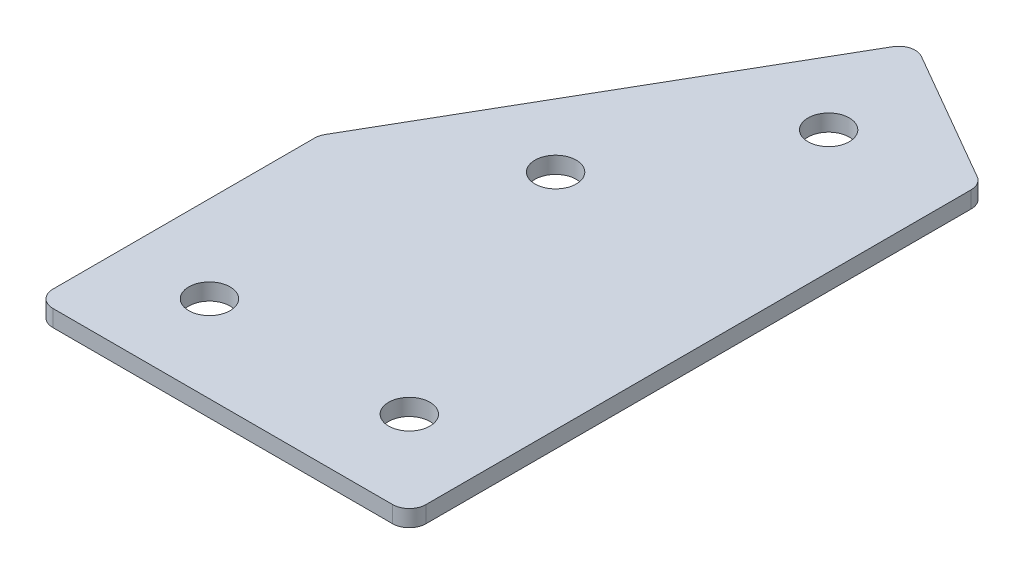
ISO-10303-21;
HEADER;
FILE_DESCRIPTION(('STEP AP214'),'2;1');
FILE_NAME('part.step','',(''),(''),'','','');
FILE_SCHEMA(('AUTOMOTIVE_DESIGN { 1 0 10303 214 1 1 1 1 }'));
ENDSEC;
DATA;
#1=APPLICATION_CONTEXT('core data for automotive mechanical design processes');
#2=APPLICATION_PROTOCOL_DEFINITION('international standard','automotive_design',2000,#1);
#3=PRODUCT_CONTEXT('',#1,'mechanical');
#4=PRODUCT('Part','Part','',(#3));
#5=PRODUCT_RELATED_PRODUCT_CATEGORY('part','',(#4));
#6=PRODUCT_DEFINITION_FORMATION('','',#4);
#7=PRODUCT_DEFINITION_CONTEXT('part definition',#1,'design');
#8=PRODUCT_DEFINITION('design','',#6,#7);
#9=PRODUCT_DEFINITION_SHAPE('','',#8);
#10=(LENGTH_UNIT() NAMED_UNIT(*) SI_UNIT(.MILLI.,.METRE.));
#11=(NAMED_UNIT(*) PLANE_ANGLE_UNIT() SI_UNIT($,.RADIAN.));
#12=(NAMED_UNIT(*) SI_UNIT($,.STERADIAN.) SOLID_ANGLE_UNIT());
#13=UNCERTAINTY_MEASURE_WITH_UNIT(LENGTH_MEASURE(1.E-05),#10,'distance_accuracy_value','');
#14=(GEOMETRIC_REPRESENTATION_CONTEXT(3) GLOBAL_UNCERTAINTY_ASSIGNED_CONTEXT((#13)) GLOBAL_UNIT_ASSIGNED_CONTEXT((#10,
#11,#12)) REPRESENTATION_CONTEXT('',''));
#15=CARTESIAN_POINT('',(0.,0.,0.));
#16=DIRECTION('',(0.,0.,1.));
#17=DIRECTION('',(1.,0.,0.));
#18=AXIS2_PLACEMENT_3D('',#15,#16,#17);
#19=CARTESIAN_POINT('',(0.,0.,0.));
#20=DIRECTION('',(0.,1.,0.));
#21=DIRECTION('',(0.,0.,1.));
#22=AXIS2_PLACEMENT_3D('',#19,#20,#21);
#23=PLANE('',#22);
#24=CARTESIAN_POINT('',(45.0000000000028,0.,0.));
#25=DIRECTION('',(0.,1.,0.));
#26=DIRECTION('',(0.,0.,1.));
#27=AXIS2_PLACEMENT_3D('',#24,#25,#26);
#28=CIRCLE('',#27,3.09999999999999);
#29=CARTESIAN_POINT('',(45.0000000000028,0.,3.09999999999999));
#30=VERTEX_POINT('',#29);
#31=EDGE_CURVE('E201',#30,#30,#28,.T.);
#32=ORIENTED_EDGE('',*,*,#31,.T.);
#33=EDGE_LOOP('',(#32));
#34=FACE_BOUND('',#33,.T.);
#35=CARTESIAN_POINT('',(39.509618943236,0.,-68.4326673973654));
#36=DIRECTION('',(0.,1.,0.));
#37=DIRECTION('',(0.,0.,1.));
#38=AXIS2_PLACEMENT_3D('',#35,#36,#37);
#39=CIRCLE('',#38,3.09999999999999);
#40=CARTESIAN_POINT('',(39.509618943236,0.,-65.3326673973654));
#41=VERTEX_POINT('',#40);
#42=EDGE_CURVE('E195',#41,#41,#39,.T.);
#43=ORIENTED_EDGE('',*,*,#42,.T.);
#44=EDGE_LOOP('',(#43));
#45=FACE_BOUND('',#44,.T.);
#46=CARTESIAN_POINT('',(24.509618943236,0.,-42.4519052838322));
#47=DIRECTION('',(0.,1.,0.));
#48=DIRECTION('',(0.,0.,1.));
#49=AXIS2_PLACEMENT_3D('',#46,#47,#48);
#50=CIRCLE('',#49,3.1);
#51=CARTESIAN_POINT('',(24.509618943236,0.,-39.3519052838323));
#52=VERTEX_POINT('',#51);
#53=EDGE_CURVE('E189',#52,#52,#50,.T.);
#54=ORIENTED_EDGE('',*,*,#53,.T.);
#55=EDGE_LOOP('',(#54));
#56=FACE_BOUND('',#55,.T.);
#57=CARTESIAN_POINT('',(15.0000000000028,0.,0.));
#58=DIRECTION('',(0.,1.,0.));
#59=DIRECTION('',(0.,0.,1.));
#60=AXIS2_PLACEMENT_3D('',#57,#58,#59);
#61=CIRCLE('',#60,3.1);
#62=CARTESIAN_POINT('',(15.0000000000028,0.,3.10000000000002));
#63=VERTEX_POINT('',#62);
#64=EDGE_CURVE('E115',#63,#63,#61,.T.);
#65=ORIENTED_EDGE('',*,*,#64,.T.);
#66=EDGE_LOOP('',(#65));
#67=FACE_BOUND('',#66,.T.);
#68=DIRECTION('',(0.,0.,1.));
#69=VECTOR('',#68,1.);
#70=CARTESIAN_POINT('',(2.00000000000279,0.,-29.4641016151382));
#71=LINE('',#70,#69);
#72=CARTESIAN_POINT('',(2.00000000000279,0.,-28.7942286340604));
#73=VERTEX_POINT('',#72);
#74=CARTESIAN_POINT('',(2.00000000000282,0.,10.5000000000001));
#75=VERTEX_POINT('',#74);
#76=EDGE_CURVE('E182',#73,#75,#71,.T.);
#77=ORIENTED_EDGE('',*,*,#76,.F.);
#78=CARTESIAN_POINT('',(4.50000000000279,0.,-28.7942286340604));
#79=DIRECTION('',(0.,1.,0.));
#80=DIRECTION('',(0.,0.,1.));
#81=AXIS2_PLACEMENT_3D('',#78,#79,#80);
#82=CIRCLE('',#81,2.5);
#83=CARTESIAN_POINT('',(2.3349364905417,0.,-30.0442286340604));
#84=VERTEX_POINT('',#83);
#85=EDGE_CURVE('E146',#73,#84,#82,.F.);
#86=ORIENTED_EDGE('',*,*,#85,.T.);
#87=DIRECTION('',(-0.5,0.,0.866025403784439));
#88=VECTOR('',#87,1.);
#89=CARTESIAN_POINT('',(34.751288694038,0.,-86.1909976465632));
#90=LINE('',#89,#88);
#91=CARTESIAN_POINT('',(33.501288694038,0.,-84.0259341371022));
#92=VERTEX_POINT('',#91);
#93=EDGE_CURVE('E174',#92,#84,#90,.T.);
#94=ORIENTED_EDGE('',*,*,#93,.F.);
#95=CARTESIAN_POINT('',(35.6663522034991,0.,-82.7759341371022));
#96=DIRECTION('',(0.,1.,0.));
#97=DIRECTION('',(0.,0.,1.));
#98=AXIS2_PLACEMENT_3D('',#95,#96,#97);
#99=CIRCLE('',#98,2.5);
#100=CARTESIAN_POINT('',(36.9163522034991,0.,-84.9409976465633));
#101=VERTEX_POINT('',#100);
#102=EDGE_CURVE('E118',#92,#101,#99,.F.);
#103=ORIENTED_EDGE('',*,*,#102,.T.);
#104=DIRECTION('',(-0.866025403784439,0.,-0.499999999999999));
#105=VECTOR('',#104,1.);
#106=CARTESIAN_POINT('',(58.0000000000028,0.,-72.7683479157526));
#107=LINE('',#106,#105);
#108=CARTESIAN_POINT('',(56.7500000000028,0.,-73.4900357522396));
#109=VERTEX_POINT('',#108);
#110=EDGE_CURVE('E119',#109,#101,#107,.T.);
#111=ORIENTED_EDGE('',*,*,#110,.F.);
#112=CARTESIAN_POINT('',(55.5000000000028,0.,-71.3249722427785));
#113=DIRECTION('',(0.,1.,0.));
#114=DIRECTION('',(0.,0.,1.));
#115=AXIS2_PLACEMENT_3D('',#112,#113,#114);
#116=CIRCLE('',#115,2.5);
#117=CARTESIAN_POINT('',(58.0000000000028,0.,-71.3249722427785));
#118=VERTEX_POINT('',#117);
#119=EDGE_CURVE('E141',#109,#118,#116,.F.);
#120=ORIENTED_EDGE('',*,*,#119,.T.);
#121=DIRECTION('',(0.,0.,-1.));
#122=VECTOR('',#121,1.);
#123=CARTESIAN_POINT('',(58.0000000000028,0.,13.0000000000001));
#124=LINE('',#123,#122);
#125=CARTESIAN_POINT('',(58.0000000000028,0.,10.5000000000001));
#126=VERTEX_POINT('',#125);
#127=EDGE_CURVE('E123',#126,#118,#124,.T.);
#128=ORIENTED_EDGE('',*,*,#127,.F.);
#129=CARTESIAN_POINT('',(55.5000000000028,0.,10.5000000000001));
#130=DIRECTION('',(0.,1.,0.));
#131=DIRECTION('',(0.,0.,1.));
#132=AXIS2_PLACEMENT_3D('',#129,#130,#131);
#133=CIRCLE('',#132,2.5);
#134=CARTESIAN_POINT('',(55.5000000000028,0.,13.0000000000001));
#135=VERTEX_POINT('',#134);
#136=EDGE_CURVE('E31',#126,#135,#133,.F.);
#137=ORIENTED_EDGE('',*,*,#136,.T.);
#138=DIRECTION('',(1.,0.,0.));
#139=VECTOR('',#138,1.);
#140=CARTESIAN_POINT('',(2.00000000000282,0.,13.0000000000001));
#141=LINE('',#140,#139);
#142=CARTESIAN_POINT('',(4.50000000000282,0.,13.0000000000001));
#143=VERTEX_POINT('',#142);
#144=EDGE_CURVE('E180',#143,#135,#141,.T.);
#145=ORIENTED_EDGE('',*,*,#144,.F.);
#146=CARTESIAN_POINT('',(4.50000000000282,0.,10.5000000000001));
#147=DIRECTION('',(0.,1.,0.));
#148=DIRECTION('',(0.,0.,1.));
#149=AXIS2_PLACEMENT_3D('',#146,#147,#148);
#150=CIRCLE('',#149,2.5);
#151=EDGE_CURVE('E144',#143,#75,#150,.F.);
#152=ORIENTED_EDGE('',*,*,#151,.T.);
#153=EDGE_LOOP('',(#77,#86,#94,#103,#111,#120,#128,#137,#145,#152));
#154=FACE_BOUND('',#153,.T.);
#155=ADVANCED_FACE('F16',(#34,#45,#56,#67,#154),#23,.F.);
#156=CARTESIAN_POINT('',(34.751288694038,0.,-86.1909976465632));
#157=DIRECTION('',(-0.866025403784439,0.,-0.5));
#158=DIRECTION('',(-0.5,0.,0.866025403784439));
#159=AXIS2_PLACEMENT_3D('',#156,#157,#158);
#160=PLANE('',#159);
#161=ORIENTED_EDGE('',*,*,#93,.T.);
#162=DIRECTION('',(0.,1.,0.));
#163=VECTOR('',#162,1.);
#164=CARTESIAN_POINT('',(2.3349364905417,0.,-30.0442286340604));
#165=LINE('',#164,#163);
#166=CARTESIAN_POINT('',(2.3349364905417,2.5,-30.0442286340604));
#167=VERTEX_POINT('',#166);
#168=EDGE_CURVE('E105',#84,#167,#165,.T.);
#169=ORIENTED_EDGE('',*,*,#168,.T.);
#170=DIRECTION('',(-0.5,0.,0.866025403784439));
#171=VECTOR('',#170,1.);
#172=CARTESIAN_POINT('',(34.751288694038,2.5,-86.1909976465632));
#173=LINE('',#172,#171);
#174=CARTESIAN_POINT('',(33.501288694038,2.5,-84.0259341371022));
#175=VERTEX_POINT('',#174);
#176=EDGE_CURVE('E97',#175,#167,#173,.T.);
#177=ORIENTED_EDGE('',*,*,#176,.F.);
#178=DIRECTION('',(0.,1.,0.));
#179=VECTOR('',#178,1.);
#180=CARTESIAN_POINT('',(33.501288694038,0.,-84.0259341371022));
#181=LINE('',#180,#179);
#182=EDGE_CURVE('E111',#175,#92,#181,.F.);
#183=ORIENTED_EDGE('',*,*,#182,.T.);
#184=EDGE_LOOP('',(#161,#169,#177,#183));
#185=FACE_BOUND('',#184,.T.);
#186=ADVANCED_FACE('F110',(#185),#160,.T.);
#187=CARTESIAN_POINT('',(58.0000000000028,0.,-72.7683479157526));
#188=DIRECTION('',(0.499999999999999,0.,-0.866025403784439));
#189=DIRECTION('',(-0.866025403784439,0.,-0.499999999999999));
#190=AXIS2_PLACEMENT_3D('',#187,#188,#189);
#191=PLANE('',#190);
#192=DIRECTION('',(-0.866025403784439,0.,-0.499999999999999));
#193=VECTOR('',#192,1.);
#194=CARTESIAN_POINT('',(58.0000000000028,2.5,-72.7683479157526));
#195=LINE('',#194,#193);
#196=CARTESIAN_POINT('',(56.7500000000028,2.5,-73.4900357522396));
#197=VERTEX_POINT('',#196);
#198=CARTESIAN_POINT('',(36.9163522034991,2.5,-84.9409976465633));
#199=VERTEX_POINT('',#198);
#200=EDGE_CURVE('E99',#197,#199,#195,.T.);
#201=ORIENTED_EDGE('',*,*,#200,.F.);
#202=DIRECTION('',(0.,1.,0.));
#203=VECTOR('',#202,1.);
#204=CARTESIAN_POINT('',(56.7500000000028,0.,-73.4900357522396));
#205=LINE('',#204,#203);
#206=EDGE_CURVE('E10',#197,#109,#205,.F.);
#207=ORIENTED_EDGE('',*,*,#206,.T.);
#208=ORIENTED_EDGE('',*,*,#110,.T.);
#209=DIRECTION('',(0.,1.,0.));
#210=VECTOR('',#209,1.);
#211=CARTESIAN_POINT('',(36.9163522034991,0.,-84.9409976465632));
#212=LINE('',#211,#210);
#213=EDGE_CURVE('E24',#101,#199,#212,.T.);
#214=ORIENTED_EDGE('',*,*,#213,.T.);
#215=EDGE_LOOP('',(#201,#207,#208,#214));
#216=FACE_BOUND('',#215,.T.);
#217=ADVANCED_FACE('F157',(#216),#191,.T.);
#218=CARTESIAN_POINT('',(58.0000000000028,0.,13.0000000000001));
#219=DIRECTION('',(1.,0.,0.));
#220=DIRECTION('',(0.,0.,-1.));
#221=AXIS2_PLACEMENT_3D('',#218,#219,#220);
#222=PLANE('',#221);
#223=DIRECTION('',(0.,0.,-1.));
#224=VECTOR('',#223,1.);
#225=CARTESIAN_POINT('',(58.0000000000028,2.5,13.0000000000001));
#226=LINE('',#225,#224);
#227=CARTESIAN_POINT('',(58.0000000000028,2.5,10.5000000000001));
#228=VERTEX_POINT('',#227);
#229=CARTESIAN_POINT('',(58.0000000000028,2.5,-71.3249722427785));
#230=VERTEX_POINT('',#229);
#231=EDGE_CURVE('E170',#228,#230,#226,.T.);
#232=ORIENTED_EDGE('',*,*,#231,.F.);
#233=DIRECTION('',(0.,1.,0.));
#234=VECTOR('',#233,1.);
#235=CARTESIAN_POINT('',(58.0000000000028,0.,10.5000000000001));
#236=LINE('',#235,#234);
#237=EDGE_CURVE('E155',#228,#126,#236,.F.);
#238=ORIENTED_EDGE('',*,*,#237,.T.);
#239=ORIENTED_EDGE('',*,*,#127,.T.);
#240=DIRECTION('',(0.,1.,0.));
#241=VECTOR('',#240,1.);
#242=CARTESIAN_POINT('',(58.0000000000028,0.,-71.3249722427785));
#243=LINE('',#242,#241);
#244=EDGE_CURVE('E152',#118,#230,#243,.T.);
#245=ORIENTED_EDGE('',*,*,#244,.T.);
#246=EDGE_LOOP('',(#232,#238,#239,#245));
#247=FACE_BOUND('',#246,.T.);
#248=ADVANCED_FACE('F169',(#247),#222,.T.);
#249=CARTESIAN_POINT('',(2.00000000000282,0.,13.0000000000001));
#250=DIRECTION('',(0.,0.,1.));
#251=DIRECTION('',(1.,0.,0.));
#252=AXIS2_PLACEMENT_3D('',#249,#250,#251);
#253=PLANE('',#252);
#254=DIRECTION('',(1.,0.,0.));
#255=VECTOR('',#254,1.);
#256=CARTESIAN_POINT('',(2.00000000000282,2.5,13.0000000000001));
#257=LINE('',#256,#255);
#258=CARTESIAN_POINT('',(4.50000000000282,2.5,13.0000000000001));
#259=VERTEX_POINT('',#258);
#260=CARTESIAN_POINT('',(55.5000000000028,2.5,13.0000000000001));
#261=VERTEX_POINT('',#260);
#262=EDGE_CURVE('E173',#259,#261,#257,.T.);
#263=ORIENTED_EDGE('',*,*,#262,.F.);
#264=DIRECTION('',(0.,1.,0.));
#265=VECTOR('',#264,1.);
#266=CARTESIAN_POINT('',(4.50000000000282,0.,13.0000000000001));
#267=LINE('',#266,#265);
#268=EDGE_CURVE('E38',#259,#143,#267,.F.);
#269=ORIENTED_EDGE('',*,*,#268,.T.);
#270=ORIENTED_EDGE('',*,*,#144,.T.);
#271=DIRECTION('',(0.,1.,0.));
#272=VECTOR('',#271,1.);
#273=CARTESIAN_POINT('',(55.5000000000028,0.,13.0000000000001));
#274=LINE('',#273,#272);
#275=EDGE_CURVE('E148',#135,#261,#274,.T.);
#276=ORIENTED_EDGE('',*,*,#275,.T.);
#277=EDGE_LOOP('',(#263,#269,#270,#276));
#278=FACE_BOUND('',#277,.T.);
#279=ADVANCED_FACE('F337',(#278),#253,.T.);
#280=CARTESIAN_POINT('',(2.00000000000279,0.,-29.4641016151382));
#281=DIRECTION('',(-1.,0.,0.));
#282=DIRECTION('',(0.,0.,1.));
#283=AXIS2_PLACEMENT_3D('',#280,#281,#282);
#284=PLANE('',#283);
#285=DIRECTION('',(0.,0.,1.));
#286=VECTOR('',#285,1.);
#287=CARTESIAN_POINT('',(2.00000000000279,2.5,-29.4641016151382));
#288=LINE('',#287,#286);
#289=CARTESIAN_POINT('',(2.00000000000279,2.5,-28.7942286340604));
#290=VERTEX_POINT('',#289);
#291=CARTESIAN_POINT('',(2.00000000000282,2.5,10.5000000000001));
#292=VERTEX_POINT('',#291);
#293=EDGE_CURVE('E114',#290,#292,#288,.T.);
#294=ORIENTED_EDGE('',*,*,#293,.F.);
#295=DIRECTION('',(0.,1.,0.));
#296=VECTOR('',#295,1.);
#297=CARTESIAN_POINT('',(2.00000000000279,0.,-28.7942286340604));
#298=LINE('',#297,#296);
#299=EDGE_CURVE('E138',#290,#73,#298,.F.);
#300=ORIENTED_EDGE('',*,*,#299,.T.);
#301=ORIENTED_EDGE('',*,*,#76,.T.);
#302=DIRECTION('',(0.,1.,0.));
#303=VECTOR('',#302,1.);
#304=CARTESIAN_POINT('',(2.00000000000282,0.,10.5000000000001));
#305=LINE('',#304,#303);
#306=EDGE_CURVE('E135',#75,#292,#305,.T.);
#307=ORIENTED_EDGE('',*,*,#306,.T.);
#308=EDGE_LOOP('',(#294,#300,#301,#307));
#309=FACE_BOUND('',#308,.T.);
#310=ADVANCED_FACE('F223',(#309),#284,.T.);
#311=CARTESIAN_POINT('',(0.,2.5,0.));
#312=DIRECTION('',(0.,1.,0.));
#313=DIRECTION('',(0.,0.,1.));
#314=AXIS2_PLACEMENT_3D('',#311,#312,#313);
#315=PLANE('',#314);
#316=CARTESIAN_POINT('',(45.0000000000028,2.5,0.));
#317=DIRECTION('',(0.,1.,0.));
#318=DIRECTION('',(0.,0.,1.));
#319=AXIS2_PLACEMENT_3D('',#316,#317,#318);
#320=CIRCLE('',#319,3.09999999999999);
#321=CARTESIAN_POINT('',(45.0000000000028,2.5,3.09999999999999));
#322=VERTEX_POINT('',#321);
#323=EDGE_CURVE('E204',#322,#322,#320,.T.);
#324=ORIENTED_EDGE('',*,*,#323,.F.);
#325=EDGE_LOOP('',(#324));
#326=FACE_BOUND('',#325,.T.);
#327=CARTESIAN_POINT('',(39.509618943236,2.5,-68.4326673973654));
#328=DIRECTION('',(0.,1.,0.));
#329=DIRECTION('',(0.,0.,1.));
#330=AXIS2_PLACEMENT_3D('',#327,#328,#329);
#331=CIRCLE('',#330,3.09999999999999);
#332=CARTESIAN_POINT('',(39.509618943236,2.5,-65.3326673973654));
#333=VERTEX_POINT('',#332);
#334=EDGE_CURVE('E198',#333,#333,#331,.T.);
#335=ORIENTED_EDGE('',*,*,#334,.F.);
#336=EDGE_LOOP('',(#335));
#337=FACE_BOUND('',#336,.T.);
#338=CARTESIAN_POINT('',(24.509618943236,2.5,-42.4519052838322));
#339=DIRECTION('',(0.,1.,0.));
#340=DIRECTION('',(0.,0.,1.));
#341=AXIS2_PLACEMENT_3D('',#338,#339,#340);
#342=CIRCLE('',#341,3.1);
#343=CARTESIAN_POINT('',(24.509618943236,2.5,-39.3519052838323));
#344=VERTEX_POINT('',#343);
#345=EDGE_CURVE('E192',#344,#344,#342,.T.);
#346=ORIENTED_EDGE('',*,*,#345,.F.);
#347=EDGE_LOOP('',(#346));
#348=FACE_BOUND('',#347,.T.);
#349=CARTESIAN_POINT('',(15.0000000000028,2.5,0.));
#350=DIRECTION('',(0.,1.,0.));
#351=DIRECTION('',(0.,0.,1.));
#352=AXIS2_PLACEMENT_3D('',#349,#350,#351);
#353=CIRCLE('',#352,3.1);
#354=CARTESIAN_POINT('',(15.0000000000028,2.5,3.10000000000002));
#355=VERTEX_POINT('',#354);
#356=EDGE_CURVE('E186',#355,#355,#353,.T.);
#357=ORIENTED_EDGE('',*,*,#356,.F.);
#358=EDGE_LOOP('',(#357));
#359=FACE_BOUND('',#358,.T.);
#360=ORIENTED_EDGE('',*,*,#176,.T.);
#361=CARTESIAN_POINT('',(4.50000000000279,2.5,-28.7942286340604));
#362=DIRECTION('',(0.,1.,0.));
#363=DIRECTION('',(0.,0.,1.));
#364=AXIS2_PLACEMENT_3D('',#361,#362,#363);
#365=CIRCLE('',#364,2.5);
#366=EDGE_CURVE('E133',#167,#290,#365,.T.);
#367=ORIENTED_EDGE('',*,*,#366,.T.);
#368=ORIENTED_EDGE('',*,*,#293,.T.);
#369=CARTESIAN_POINT('',(4.50000000000282,2.5,10.5000000000001));
#370=DIRECTION('',(0.,1.,0.));
#371=DIRECTION('',(0.,0.,1.));
#372=AXIS2_PLACEMENT_3D('',#369,#370,#371);
#373=CIRCLE('',#372,2.5);
#374=EDGE_CURVE('E131',#292,#259,#373,.T.);
#375=ORIENTED_EDGE('',*,*,#374,.T.);
#376=ORIENTED_EDGE('',*,*,#262,.T.);
#377=CARTESIAN_POINT('',(55.5000000000028,2.5,10.5000000000001));
#378=DIRECTION('',(0.,1.,0.));
#379=DIRECTION('',(0.,0.,1.));
#380=AXIS2_PLACEMENT_3D('',#377,#378,#379);
#381=CIRCLE('',#380,2.5);
#382=EDGE_CURVE('E129',#261,#228,#381,.T.);
#383=ORIENTED_EDGE('',*,*,#382,.T.);
#384=ORIENTED_EDGE('',*,*,#231,.T.);
#385=CARTESIAN_POINT('',(55.5000000000028,2.5,-71.3249722427785));
#386=DIRECTION('',(0.,1.,0.));
#387=DIRECTION('',(0.,0.,1.));
#388=AXIS2_PLACEMENT_3D('',#385,#386,#387);
#389=CIRCLE('',#388,2.5);
#390=EDGE_CURVE('E104',#230,#197,#389,.T.);
#391=ORIENTED_EDGE('',*,*,#390,.T.);
#392=ORIENTED_EDGE('',*,*,#200,.T.);
#393=CARTESIAN_POINT('',(35.6663522034991,2.5,-82.7759341371022));
#394=DIRECTION('',(0.,1.,0.));
#395=DIRECTION('',(0.,0.,1.));
#396=AXIS2_PLACEMENT_3D('',#393,#394,#395);
#397=CIRCLE('',#396,2.5);
#398=EDGE_CURVE('E94',#199,#175,#397,.T.);
#399=ORIENTED_EDGE('',*,*,#398,.T.);
#400=EDGE_LOOP('',(#360,#367,#368,#375,#376,#383,#384,#391,#392,#399));
#401=FACE_BOUND('',#400,.T.);
#402=ADVANCED_FACE('F96',(#326,#337,#348,#359,#401),#315,.T.);
#403=CARTESIAN_POINT('',(15.0000000000028,0.,0.));
#404=DIRECTION('',(0.,1.,0.));
#405=DIRECTION('',(0.,0.,1.));
#406=AXIS2_PLACEMENT_3D('',#403,#404,#405);
#407=CYLINDRICAL_SURFACE('',#406,3.1);
#408=ORIENTED_EDGE('',*,*,#64,.F.);
#409=EDGE_LOOP('',(#408));
#410=FACE_BOUND('',#409,.T.);
#411=ORIENTED_EDGE('',*,*,#356,.T.);
#412=EDGE_LOOP('',(#411));
#413=FACE_BOUND('',#412,.T.);
#414=ADVANCED_FACE('F222',(#410,#413),#407,.F.);
#415=CARTESIAN_POINT('',(24.509618943236,0.,-42.4519052838322));
#416=DIRECTION('',(0.,1.,0.));
#417=DIRECTION('',(0.,0.,1.));
#418=AXIS2_PLACEMENT_3D('',#415,#416,#417);
#419=CYLINDRICAL_SURFACE('',#418,3.1);
#420=ORIENTED_EDGE('',*,*,#53,.F.);
#421=EDGE_LOOP('',(#420));
#422=FACE_BOUND('',#421,.T.);
#423=ORIENTED_EDGE('',*,*,#345,.T.);
#424=EDGE_LOOP('',(#423));
#425=FACE_BOUND('',#424,.T.);
#426=ADVANCED_FACE('F232',(#422,#425),#419,.F.);
#427=CARTESIAN_POINT('',(39.509618943236,0.,-68.4326673973654));
#428=DIRECTION('',(0.,1.,0.));
#429=DIRECTION('',(0.,0.,1.));
#430=AXIS2_PLACEMENT_3D('',#427,#428,#429);
#431=CYLINDRICAL_SURFACE('',#430,3.09999999999999);
#432=ORIENTED_EDGE('',*,*,#42,.F.);
#433=EDGE_LOOP('',(#432));
#434=FACE_BOUND('',#433,.T.);
#435=ORIENTED_EDGE('',*,*,#334,.T.);
#436=EDGE_LOOP('',(#435));
#437=FACE_BOUND('',#436,.T.);
#438=ADVANCED_FACE('F216',(#434,#437),#431,.F.);
#439=CARTESIAN_POINT('',(45.0000000000028,0.,0.));
#440=DIRECTION('',(0.,1.,0.));
#441=DIRECTION('',(0.,0.,1.));
#442=AXIS2_PLACEMENT_3D('',#439,#440,#441);
#443=CYLINDRICAL_SURFACE('',#442,3.09999999999999);
#444=ORIENTED_EDGE('',*,*,#31,.F.);
#445=EDGE_LOOP('',(#444));
#446=FACE_BOUND('',#445,.T.);
#447=ORIENTED_EDGE('',*,*,#323,.T.);
#448=EDGE_LOOP('',(#447));
#449=FACE_BOUND('',#448,.T.);
#450=ADVANCED_FACE('F212',(#446,#449),#443,.F.);
#451=CARTESIAN_POINT('',(4.50000000000279,0.,-28.7942286340604));
#452=DIRECTION('',(0.,1.,0.));
#453=DIRECTION('',(0.,0.,1.));
#454=AXIS2_PLACEMENT_3D('',#451,#452,#453);
#455=CYLINDRICAL_SURFACE('',#454,2.5);
#456=ORIENTED_EDGE('',*,*,#85,.F.);
#457=ORIENTED_EDGE('',*,*,#299,.F.);
#458=ORIENTED_EDGE('',*,*,#366,.F.);
#459=ORIENTED_EDGE('',*,*,#168,.F.);
#460=EDGE_LOOP('',(#456,#457,#458,#459));
#461=FACE_BOUND('',#460,.T.);
#462=ADVANCED_FACE('F215',(#461),#455,.T.);
#463=CARTESIAN_POINT('',(4.50000000000282,0.,10.5000000000001));
#464=DIRECTION('',(0.,1.,0.));
#465=DIRECTION('',(0.,0.,1.));
#466=AXIS2_PLACEMENT_3D('',#463,#464,#465);
#467=CYLINDRICAL_SURFACE('',#466,2.5);
#468=ORIENTED_EDGE('',*,*,#151,.F.);
#469=ORIENTED_EDGE('',*,*,#268,.F.);
#470=ORIENTED_EDGE('',*,*,#374,.F.);
#471=ORIENTED_EDGE('',*,*,#306,.F.);
#472=EDGE_LOOP('',(#468,#469,#470,#471));
#473=FACE_BOUND('',#472,.T.);
#474=ADVANCED_FACE('F252',(#473),#467,.T.);
#475=CARTESIAN_POINT('',(55.5000000000028,0.,10.5000000000001));
#476=DIRECTION('',(0.,1.,0.));
#477=DIRECTION('',(0.,0.,1.));
#478=AXIS2_PLACEMENT_3D('',#475,#476,#477);
#479=CYLINDRICAL_SURFACE('',#478,2.5);
#480=ORIENTED_EDGE('',*,*,#136,.F.);
#481=ORIENTED_EDGE('',*,*,#237,.F.);
#482=ORIENTED_EDGE('',*,*,#382,.F.);
#483=ORIENTED_EDGE('',*,*,#275,.F.);
#484=EDGE_LOOP('',(#480,#481,#482,#483));
#485=FACE_BOUND('',#484,.T.);
#486=ADVANCED_FACE('F256',(#485),#479,.T.);
#487=CARTESIAN_POINT('',(55.5000000000028,0.,-71.3249722427785));
#488=DIRECTION('',(0.,1.,0.));
#489=DIRECTION('',(0.,0.,1.));
#490=AXIS2_PLACEMENT_3D('',#487,#488,#489);
#491=CYLINDRICAL_SURFACE('',#490,2.5);
#492=ORIENTED_EDGE('',*,*,#119,.F.);
#493=ORIENTED_EDGE('',*,*,#206,.F.);
#494=ORIENTED_EDGE('',*,*,#390,.F.);
#495=ORIENTED_EDGE('',*,*,#244,.F.);
#496=EDGE_LOOP('',(#492,#493,#494,#495));
#497=FACE_BOUND('',#496,.T.);
#498=ADVANCED_FACE('F165',(#497),#491,.T.);
#499=CARTESIAN_POINT('',(35.6663522034991,0.,-82.7759341371022));
#500=DIRECTION('',(0.,1.,0.));
#501=DIRECTION('',(0.,0.,1.));
#502=AXIS2_PLACEMENT_3D('',#499,#500,#501);
#503=CYLINDRICAL_SURFACE('',#502,2.5);
#504=ORIENTED_EDGE('',*,*,#102,.F.);
#505=ORIENTED_EDGE('',*,*,#182,.F.);
#506=ORIENTED_EDGE('',*,*,#398,.F.);
#507=ORIENTED_EDGE('',*,*,#213,.F.);
#508=EDGE_LOOP('',(#504,#505,#506,#507));
#509=FACE_BOUND('',#508,.T.);
#510=ADVANCED_FACE('F18',(#509),#503,.T.);
#511=CLOSED_SHELL('',(#155,#186,#217,#248,#279,#310,#402,#414,#426,#438,#450,#462,#474,#486,
#498,#510));
#512=MANIFOLD_SOLID_BREP('B1',#511);
#513=ADVANCED_BREP_SHAPE_REPRESENTATION('',(#18,#512),#14);
#514=SHAPE_DEFINITION_REPRESENTATION(#9,#513);
ENDSEC;
END-ISO-10303-21;
